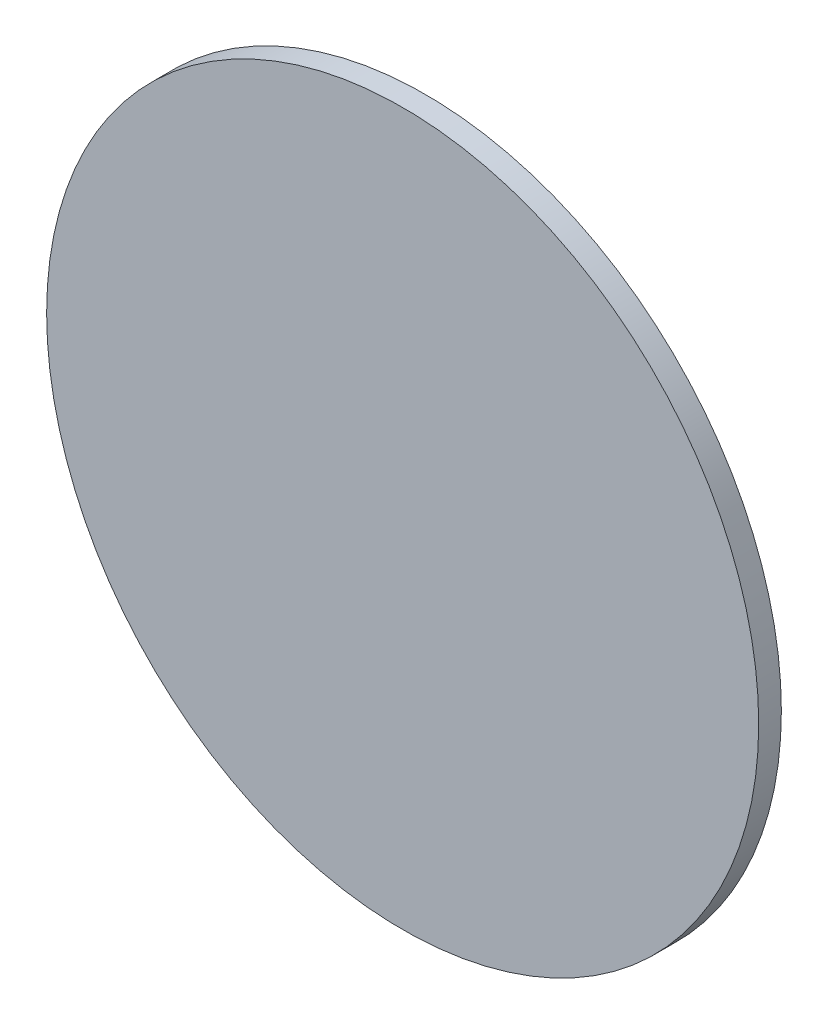
ISO-10303-21;
HEADER;
FILE_DESCRIPTION(('STEP AP214'),'2;1');
FILE_NAME('part.step','',(''),(''),'','','');
FILE_SCHEMA(('AUTOMOTIVE_DESIGN { 1 0 10303 214 1 1 1 1 }'));
ENDSEC;
DATA;
#1=APPLICATION_CONTEXT('core data for automotive mechanical design processes');
#2=APPLICATION_PROTOCOL_DEFINITION('international standard','automotive_design',2000,#1);
#3=PRODUCT_CONTEXT('',#1,'mechanical');
#4=PRODUCT('Part','Part','',(#3));
#5=PRODUCT_RELATED_PRODUCT_CATEGORY('part','',(#4));
#6=PRODUCT_DEFINITION_FORMATION('','',#4);
#7=PRODUCT_DEFINITION_CONTEXT('part definition',#1,'design');
#8=PRODUCT_DEFINITION('design','',#6,#7);
#9=PRODUCT_DEFINITION_SHAPE('','',#8);
#10=(LENGTH_UNIT() NAMED_UNIT(*) SI_UNIT(.MILLI.,.METRE.));
#11=(NAMED_UNIT(*) PLANE_ANGLE_UNIT() SI_UNIT($,.RADIAN.));
#12=(NAMED_UNIT(*) SI_UNIT($,.STERADIAN.) SOLID_ANGLE_UNIT());
#13=UNCERTAINTY_MEASURE_WITH_UNIT(LENGTH_MEASURE(1.E-05),#10,'distance_accuracy_value','');
#14=(GEOMETRIC_REPRESENTATION_CONTEXT(3) GLOBAL_UNCERTAINTY_ASSIGNED_CONTEXT((#13)) GLOBAL_UNIT_ASSIGNED_CONTEXT((#10,
#11,#12)) REPRESENTATION_CONTEXT('',''));
#15=CARTESIAN_POINT('',(0.,0.,0.));
#16=DIRECTION('',(0.,0.,1.));
#17=DIRECTION('',(1.,0.,0.));
#18=AXIS2_PLACEMENT_3D('',#15,#16,#17);
#19=CARTESIAN_POINT('',(0.,0.,1.5875));
#20=DIRECTION('',(0.,0.,-1.));
#21=DIRECTION('',(-1.,0.,0.));
#22=AXIS2_PLACEMENT_3D('',#19,#20,#21);
#23=CYLINDRICAL_SURFACE('',#22,24.9555);
#24=CARTESIAN_POINT('',(0.,0.,1.5875));
#25=DIRECTION('',(0.,0.,1.));
#26=DIRECTION('',(1.,0.,0.));
#27=AXIS2_PLACEMENT_3D('',#24,#25,#26);
#28=CIRCLE('',#27,24.9555);
#29=CARTESIAN_POINT('',(24.9555,0.,1.5875));
#30=VERTEX_POINT('',#29);
#31=EDGE_CURVE('E10',#30,#30,#28,.T.);
#32=ORIENTED_EDGE('',*,*,#31,.F.);
#33=EDGE_LOOP('',(#32));
#34=FACE_BOUND('',#33,.T.);
#35=CARTESIAN_POINT('',(0.,0.,0.));
#36=DIRECTION('',(0.,0.,1.));
#37=DIRECTION('',(1.,0.,0.));
#38=AXIS2_PLACEMENT_3D('',#35,#36,#37);
#39=CIRCLE('',#38,24.9555);
#40=CARTESIAN_POINT('',(24.9555,0.,0.));
#41=VERTEX_POINT('',#40);
#42=EDGE_CURVE('E34',#41,#41,#39,.T.);
#43=ORIENTED_EDGE('',*,*,#42,.T.);
#44=EDGE_LOOP('',(#43));
#45=FACE_BOUND('',#44,.T.);
#46=ADVANCED_FACE('F31',(#34,#45),#23,.T.);
#47=CARTESIAN_POINT('',(0.,0.,1.5875));
#48=DIRECTION('',(0.,0.,1.));
#49=DIRECTION('',(1.,0.,0.));
#50=AXIS2_PLACEMENT_3D('',#47,#48,#49);
#51=PLANE('',#50);
#52=ORIENTED_EDGE('',*,*,#31,.T.);
#53=EDGE_LOOP('',(#52));
#54=FACE_BOUND('',#53,.T.);
#55=ADVANCED_FACE('F46',(#54),#51,.T.);
#56=CARTESIAN_POINT('',(0.,0.,0.));
#57=DIRECTION('',(0.,0.,1.));
#58=DIRECTION('',(1.,0.,0.));
#59=AXIS2_PLACEMENT_3D('',#56,#57,#58);
#60=PLANE('',#59);
#61=ORIENTED_EDGE('',*,*,#42,.F.);
#62=EDGE_LOOP('',(#61));
#63=FACE_BOUND('',#62,.T.);
#64=ADVANCED_FACE('F44',(#63),#60,.F.);
#65=CLOSED_SHELL('',(#46,#55,#64));
#66=MANIFOLD_SOLID_BREP('B2',#65);
#67=ADVANCED_BREP_SHAPE_REPRESENTATION('',(#18,#66),#14);
#68=SHAPE_DEFINITION_REPRESENTATION(#9,#67);
ENDSEC;
END-ISO-10303-21;
